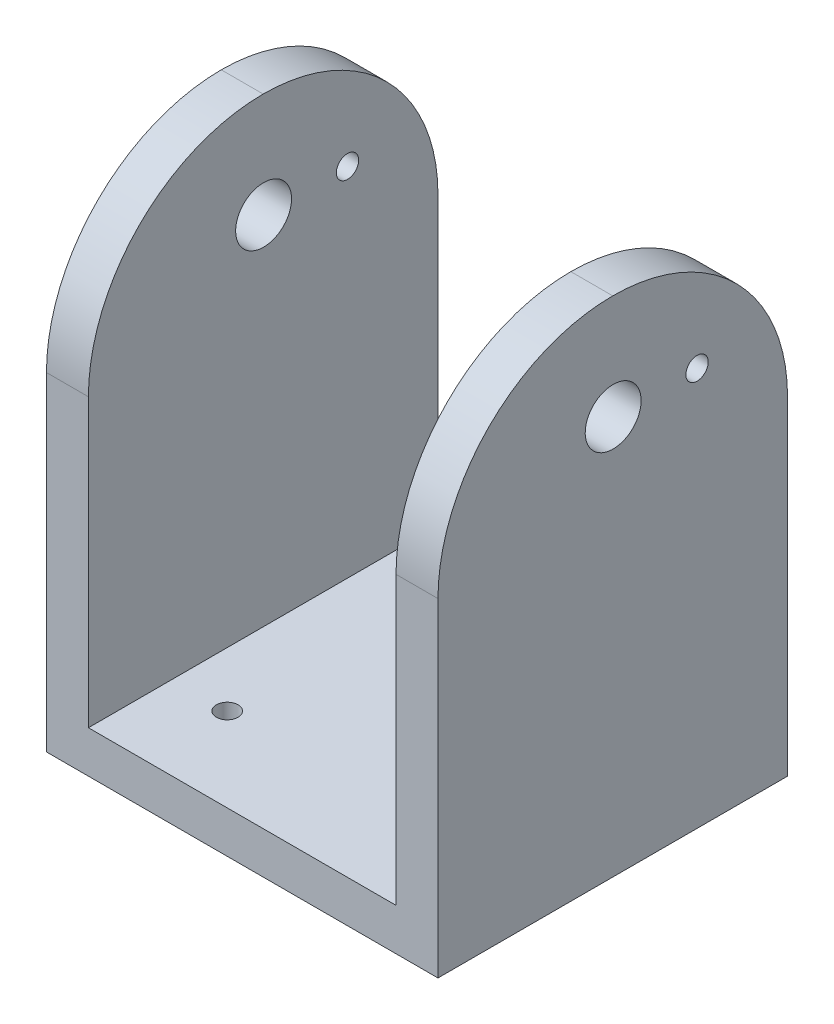
ISO-10303-21;
HEADER;
FILE_DESCRIPTION(('STEP AP214'),'2;1');
FILE_NAME('part.step','',(''),(''),'','','');
FILE_SCHEMA(('AUTOMOTIVE_DESIGN { 1 0 10303 214 1 1 1 1 }'));
ENDSEC;
DATA;
#1=APPLICATION_CONTEXT('core data for automotive mechanical design processes');
#2=APPLICATION_PROTOCOL_DEFINITION('international standard','automotive_design',2000,#1);
#3=PRODUCT_CONTEXT('',#1,'mechanical');
#4=PRODUCT('Part','Part','',(#3));
#5=PRODUCT_RELATED_PRODUCT_CATEGORY('part','',(#4));
#6=PRODUCT_DEFINITION_FORMATION('','',#4);
#7=PRODUCT_DEFINITION_CONTEXT('part definition',#1,'design');
#8=PRODUCT_DEFINITION('design','',#6,#7);
#9=PRODUCT_DEFINITION_SHAPE('','',#8);
#10=(LENGTH_UNIT() NAMED_UNIT(*) SI_UNIT(.MILLI.,.METRE.));
#11=(NAMED_UNIT(*) PLANE_ANGLE_UNIT() SI_UNIT($,.RADIAN.));
#12=(NAMED_UNIT(*) SI_UNIT($,.STERADIAN.) SOLID_ANGLE_UNIT());
#13=UNCERTAINTY_MEASURE_WITH_UNIT(LENGTH_MEASURE(1.E-05),#10,'distance_accuracy_value','');
#14=(GEOMETRIC_REPRESENTATION_CONTEXT(3) GLOBAL_UNCERTAINTY_ASSIGNED_CONTEXT((#13)) GLOBAL_UNIT_ASSIGNED_CONTEXT((#10,
#11,#12)) REPRESENTATION_CONTEXT('',''));
#15=CARTESIAN_POINT('',(0.,0.,0.));
#16=DIRECTION('',(0.,0.,1.));
#17=DIRECTION('',(1.,0.,0.));
#18=AXIS2_PLACEMENT_3D('',#15,#16,#17);
#19=CARTESIAN_POINT('',(-28.,0.,50.));
#20=DIRECTION('',(-1.,0.,0.));
#21=DIRECTION('',(0.,0.,1.));
#22=AXIS2_PLACEMENT_3D('',#19,#20,#21);
#23=PLANE('',#22);
#24=CARTESIAN_POINT('',(-28.,30.,12.9412459016393));
#25=DIRECTION('',(1.,0.,0.));
#26=DIRECTION('',(0.,1.,0.));
#27=AXIS2_PLACEMENT_3D('',#24,#25,#26);
#28=CIRCLE('',#27,1.6);
#29=CARTESIAN_POINT('',(-28.,31.6,12.9412459016393));
#30=VERTEX_POINT('',#29);
#31=EDGE_CURVE('E196',#30,#30,#28,.T.);
#32=ORIENTED_EDGE('',*,*,#31,.T.);
#33=EDGE_LOOP('',(#32));
#34=FACE_BOUND('',#33,.T.);
#35=CARTESIAN_POINT('',(-28.,30.,24.9412459016393));
#36=DIRECTION('',(1.,0.,0.));
#37=DIRECTION('',(0.,1.,0.));
#38=AXIS2_PLACEMENT_3D('',#35,#36,#37);
#39=CIRCLE('',#38,4.);
#40=CARTESIAN_POINT('',(-28.,34.,24.9412459016393));
#41=VERTEX_POINT('',#40);
#42=EDGE_CURVE('E214',#41,#41,#39,.T.);
#43=ORIENTED_EDGE('',*,*,#42,.T.);
#44=EDGE_LOOP('',(#43));
#45=FACE_BOUND('',#44,.T.);
#46=DIRECTION('',(0.,1.,0.));
#47=VECTOR('',#46,1.);
#48=CARTESIAN_POINT('',(-28.,0.,50.));
#49=LINE('',#48,#47);
#50=CARTESIAN_POINT('',(-28.,-27.,50.));
#51=VERTEX_POINT('',#50);
#52=CARTESIAN_POINT('',(-28.,20.,50.));
#53=VERTEX_POINT('',#52);
#54=EDGE_CURVE('E115',#51,#53,#49,.T.);
#55=ORIENTED_EDGE('',*,*,#54,.T.);
#56=CARTESIAN_POINT('',(-28.,20.,25.));
#57=DIRECTION('',(-1.,0.,0.));
#58=DIRECTION('',(0.,0.,1.));
#59=AXIS2_PLACEMENT_3D('',#56,#57,#58);
#60=CIRCLE('',#59,25.);
#61=CARTESIAN_POINT('',(-28.,45.,25.));
#62=VERTEX_POINT('',#61);
#63=EDGE_CURVE('E178',#53,#62,#60,.T.);
#64=ORIENTED_EDGE('',*,*,#63,.T.);
#65=CARTESIAN_POINT('',(-28.,20.,25.));
#66=DIRECTION('',(-1.,0.,0.));
#67=DIRECTION('',(0.,0.,1.));
#68=AXIS2_PLACEMENT_3D('',#65,#66,#67);
#69=CIRCLE('',#68,25.);
#70=CARTESIAN_POINT('',(-28.,20.,0.));
#71=VERTEX_POINT('',#70);
#72=EDGE_CURVE('E176',#62,#71,#69,.T.);
#73=ORIENTED_EDGE('',*,*,#72,.T.);
#74=DIRECTION('',(0.,1.,0.));
#75=VECTOR('',#74,1.);
#76=CARTESIAN_POINT('',(-28.,0.,0.));
#77=LINE('',#76,#75);
#78=CARTESIAN_POINT('',(-28.,-27.,0.));
#79=VERTEX_POINT('',#78);
#80=EDGE_CURVE('E117',#79,#71,#77,.T.);
#81=ORIENTED_EDGE('',*,*,#80,.F.);
#82=DIRECTION('',(0.,0.,-1.));
#83=VECTOR('',#82,1.);
#84=CARTESIAN_POINT('',(-28.,-27.,50.));
#85=LINE('',#84,#83);
#86=EDGE_CURVE('E112',#51,#79,#85,.T.);
#87=ORIENTED_EDGE('',*,*,#86,.F.);
#88=EDGE_LOOP('',(#55,#64,#73,#81,#87));
#89=FACE_BOUND('',#88,.T.);
#90=ADVANCED_FACE('F34',(#34,#45,#89),#23,.T.);
#91=CARTESIAN_POINT('',(0.,-27.,50.));
#92=DIRECTION('',(0.,1.,0.));
#93=DIRECTION('',(-1.,0.,0.));
#94=AXIS2_PLACEMENT_3D('',#91,#92,#93);
#95=PLANE('',#94);
#96=CARTESIAN_POINT('',(14.1421356237309,-27.,37.9999999999999));
#97=DIRECTION('',(0.,1.,0.));
#98=DIRECTION('',(0.,0.,1.));
#99=AXIS2_PLACEMENT_3D('',#96,#97,#98);
#100=CIRCLE('',#99,1.55);
#101=CARTESIAN_POINT('',(14.1421356237309,-27.,39.5499999999999));
#102=VERTEX_POINT('',#101);
#103=EDGE_CURVE('E216',#102,#102,#100,.T.);
#104=ORIENTED_EDGE('',*,*,#103,.T.);
#105=EDGE_LOOP('',(#104));
#106=FACE_BOUND('',#105,.T.);
#107=CARTESIAN_POINT('',(-14.142135623731,-27.,38.));
#108=DIRECTION('',(0.,1.,0.));
#109=DIRECTION('',(0.,0.,1.));
#110=AXIS2_PLACEMENT_3D('',#107,#108,#109);
#111=CIRCLE('',#110,1.55);
#112=CARTESIAN_POINT('',(-14.142135623731,-27.,39.55));
#113=VERTEX_POINT('',#112);
#114=EDGE_CURVE('E225',#113,#113,#111,.T.);
#115=ORIENTED_EDGE('',*,*,#114,.T.);
#116=EDGE_LOOP('',(#115));
#117=FACE_BOUND('',#116,.T.);
#118=CARTESIAN_POINT('',(0.,-27.,13.));
#119=DIRECTION('',(0.,1.,0.));
#120=DIRECTION('',(0.,0.,1.));
#121=AXIS2_PLACEMENT_3D('',#118,#119,#120);
#122=CIRCLE('',#121,1.55);
#123=CARTESIAN_POINT('',(0.,-27.,14.55));
#124=VERTEX_POINT('',#123);
#125=EDGE_CURVE('E232',#124,#124,#122,.T.);
#126=ORIENTED_EDGE('',*,*,#125,.T.);
#127=EDGE_LOOP('',(#126));
#128=FACE_BOUND('',#127,.T.);
#129=DIRECTION('',(1.,0.,0.));
#130=VECTOR('',#129,1.);
#131=CARTESIAN_POINT('',(0.,-27.,0.));
#132=LINE('',#131,#130);
#133=CARTESIAN_POINT('',(28.,-27.,0.));
#134=VERTEX_POINT('',#133);
#135=EDGE_CURVE('E156',#79,#134,#132,.T.);
#136=ORIENTED_EDGE('',*,*,#135,.T.);
#137=DIRECTION('',(0.,0.,-1.));
#138=VECTOR('',#137,1.);
#139=CARTESIAN_POINT('',(28.,-27.,50.));
#140=LINE('',#139,#138);
#141=CARTESIAN_POINT('',(28.,-27.,50.));
#142=VERTEX_POINT('',#141);
#143=EDGE_CURVE('E121',#142,#134,#140,.T.);
#144=ORIENTED_EDGE('',*,*,#143,.F.);
#145=DIRECTION('',(1.,0.,0.));
#146=VECTOR('',#145,1.);
#147=CARTESIAN_POINT('',(0.,-27.,50.));
#148=LINE('',#147,#146);
#149=EDGE_CURVE('E124',#51,#142,#148,.T.);
#150=ORIENTED_EDGE('',*,*,#149,.F.);
#151=ORIENTED_EDGE('',*,*,#86,.T.);
#152=EDGE_LOOP('',(#136,#144,#150,#151));
#153=FACE_BOUND('',#152,.T.);
#154=ADVANCED_FACE('F125',(#106,#117,#128,#153),#95,.F.);
#155=CARTESIAN_POINT('',(28.,0.,50.));
#156=DIRECTION('',(-1.,0.,0.));
#157=DIRECTION('',(0.,-1.,0.));
#158=AXIS2_PLACEMENT_3D('',#155,#156,#157);
#159=PLANE('',#158);
#160=CARTESIAN_POINT('',(28.,30.,12.9412459016393));
#161=DIRECTION('',(1.,0.,0.));
#162=DIRECTION('',(0.,1.,0.));
#163=AXIS2_PLACEMENT_3D('',#160,#161,#162);
#164=CIRCLE('',#163,1.6);
#165=CARTESIAN_POINT('',(28.,31.6,12.9412459016393));
#166=VERTEX_POINT('',#165);
#167=EDGE_CURVE('E201',#166,#166,#164,.T.);
#168=ORIENTED_EDGE('',*,*,#167,.F.);
#169=EDGE_LOOP('',(#168));
#170=FACE_BOUND('',#169,.T.);
#171=CARTESIAN_POINT('',(28.,30.,24.9412459016393));
#172=DIRECTION('',(1.,0.,0.));
#173=DIRECTION('',(0.,1.,0.));
#174=AXIS2_PLACEMENT_3D('',#171,#172,#173);
#175=CIRCLE('',#174,4.);
#176=CARTESIAN_POINT('',(28.,34.,24.9412459016393));
#177=VERTEX_POINT('',#176);
#178=EDGE_CURVE('E206',#177,#177,#175,.T.);
#179=ORIENTED_EDGE('',*,*,#178,.F.);
#180=EDGE_LOOP('',(#179));
#181=FACE_BOUND('',#180,.T.);
#182=DIRECTION('',(0.,1.,0.));
#183=VECTOR('',#182,1.);
#184=CARTESIAN_POINT('',(28.,0.,0.));
#185=LINE('',#184,#183);
#186=CARTESIAN_POINT('',(28.,20.,0.));
#187=VERTEX_POINT('',#186);
#188=EDGE_CURVE('E159',#134,#187,#185,.T.);
#189=ORIENTED_EDGE('',*,*,#188,.T.);
#190=CARTESIAN_POINT('',(28.,20.,25.));
#191=DIRECTION('',(-1.,0.,0.));
#192=DIRECTION('',(0.,-1.,0.));
#193=AXIS2_PLACEMENT_3D('',#190,#191,#192);
#194=CIRCLE('',#193,25.);
#195=CARTESIAN_POINT('',(28.,45.,25.));
#196=VERTEX_POINT('',#195);
#197=EDGE_CURVE('E57',#187,#196,#194,.F.);
#198=ORIENTED_EDGE('',*,*,#197,.T.);
#199=CARTESIAN_POINT('',(28.,20.,25.));
#200=DIRECTION('',(-1.,0.,0.));
#201=DIRECTION('',(0.,-1.,0.));
#202=AXIS2_PLACEMENT_3D('',#199,#200,#201);
#203=CIRCLE('',#202,25.);
#204=CARTESIAN_POINT('',(28.,20.,50.));
#205=VERTEX_POINT('',#204);
#206=EDGE_CURVE('E185',#196,#205,#203,.F.);
#207=ORIENTED_EDGE('',*,*,#206,.T.);
#208=DIRECTION('',(0.,1.,0.));
#209=VECTOR('',#208,1.);
#210=CARTESIAN_POINT('',(28.,0.,50.));
#211=LINE('',#210,#209);
#212=EDGE_CURVE('E130',#142,#205,#211,.T.);
#213=ORIENTED_EDGE('',*,*,#212,.F.);
#214=ORIENTED_EDGE('',*,*,#143,.T.);
#215=EDGE_LOOP('',(#189,#198,#207,#213,#214));
#216=FACE_BOUND('',#215,.T.);
#217=ADVANCED_FACE('F273',(#170,#181,#216),#159,.F.);
#218=CARTESIAN_POINT('',(22.,0.,50.));
#219=DIRECTION('',(-1.,0.,0.));
#220=DIRECTION('',(0.,0.,1.));
#221=AXIS2_PLACEMENT_3D('',#218,#219,#220);
#222=PLANE('',#221);
#223=CARTESIAN_POINT('',(22.,30.,12.9412459016393));
#224=DIRECTION('',(-1.,0.,0.));
#225=DIRECTION('',(0.,0.,1.));
#226=AXIS2_PLACEMENT_3D('',#223,#224,#225);
#227=CIRCLE('',#226,1.6);
#228=CARTESIAN_POINT('',(22.,31.6,12.9412459016393));
#229=VERTEX_POINT('',#228);
#230=EDGE_CURVE('E143',#229,#229,#227,.T.);
#231=ORIENTED_EDGE('',*,*,#230,.F.);
#232=EDGE_LOOP('',(#231));
#233=FACE_BOUND('',#232,.T.);
#234=CARTESIAN_POINT('',(22.,30.,24.9412459016393));
#235=DIRECTION('',(-1.,0.,0.));
#236=DIRECTION('',(0.,0.,1.));
#237=AXIS2_PLACEMENT_3D('',#234,#235,#236);
#238=CIRCLE('',#237,4.);
#239=CARTESIAN_POINT('',(22.,34.,24.9412459016393));
#240=VERTEX_POINT('',#239);
#241=EDGE_CURVE('E195',#240,#240,#238,.T.);
#242=ORIENTED_EDGE('',*,*,#241,.F.);
#243=EDGE_LOOP('',(#242));
#244=FACE_BOUND('',#243,.T.);
#245=CARTESIAN_POINT('',(22.,20.,25.));
#246=DIRECTION('',(-1.,0.,0.));
#247=DIRECTION('',(0.,0.,1.));
#248=AXIS2_PLACEMENT_3D('',#245,#246,#247);
#249=CIRCLE('',#248,25.);
#250=CARTESIAN_POINT('',(22.,20.,50.));
#251=VERTEX_POINT('',#250);
#252=CARTESIAN_POINT('',(22.,45.,25.));
#253=VERTEX_POINT('',#252);
#254=EDGE_CURVE('E43',#251,#253,#249,.T.);
#255=ORIENTED_EDGE('',*,*,#254,.T.);
#256=CARTESIAN_POINT('',(22.,20.,25.));
#257=DIRECTION('',(-1.,0.,0.));
#258=DIRECTION('',(0.,0.,1.));
#259=AXIS2_PLACEMENT_3D('',#256,#257,#258);
#260=CIRCLE('',#259,25.);
#261=CARTESIAN_POINT('',(22.,20.,0.));
#262=VERTEX_POINT('',#261);
#263=EDGE_CURVE('E11',#253,#262,#260,.T.);
#264=ORIENTED_EDGE('',*,*,#263,.T.);
#265=DIRECTION('',(0.,1.,0.));
#266=VECTOR('',#265,1.);
#267=CARTESIAN_POINT('',(22.,0.,0.));
#268=LINE('',#267,#266);
#269=CARTESIAN_POINT('',(22.,-21.,0.));
#270=VERTEX_POINT('',#269);
#271=EDGE_CURVE('E161',#270,#262,#268,.T.);
#272=ORIENTED_EDGE('',*,*,#271,.F.);
#273=DIRECTION('',(0.,0.,-1.));
#274=VECTOR('',#273,1.);
#275=CARTESIAN_POINT('',(22.,-21.,50.));
#276=LINE('',#275,#274);
#277=CARTESIAN_POINT('',(22.,-21.,50.));
#278=VERTEX_POINT('',#277);
#279=EDGE_CURVE('E167',#278,#270,#276,.T.);
#280=ORIENTED_EDGE('',*,*,#279,.F.);
#281=DIRECTION('',(0.,1.,0.));
#282=VECTOR('',#281,1.);
#283=CARTESIAN_POINT('',(22.,0.,50.));
#284=LINE('',#283,#282);
#285=EDGE_CURVE('E147',#278,#251,#284,.T.);
#286=ORIENTED_EDGE('',*,*,#285,.T.);
#287=EDGE_LOOP('',(#255,#264,#272,#280,#286));
#288=FACE_BOUND('',#287,.T.);
#289=ADVANCED_FACE('F245',(#233,#244,#288),#222,.T.);
#290=CARTESIAN_POINT('',(0.,-21.,50.));
#291=DIRECTION('',(0.,1.,0.));
#292=DIRECTION('',(0.,0.,1.));
#293=AXIS2_PLACEMENT_3D('',#290,#291,#292);
#294=PLANE('',#293);
#295=CARTESIAN_POINT('',(14.1421356237309,-21.,37.9999999999999));
#296=DIRECTION('',(0.,1.,0.));
#297=DIRECTION('',(0.,0.,1.));
#298=AXIS2_PLACEMENT_3D('',#295,#296,#297);
#299=CIRCLE('',#298,1.55);
#300=CARTESIAN_POINT('',(14.1421356237309,-21.,39.5499999999999));
#301=VERTEX_POINT('',#300);
#302=EDGE_CURVE('E220',#301,#301,#299,.T.);
#303=ORIENTED_EDGE('',*,*,#302,.F.);
#304=EDGE_LOOP('',(#303));
#305=FACE_BOUND('',#304,.T.);
#306=CARTESIAN_POINT('',(-14.142135623731,-21.,38.));
#307=DIRECTION('',(0.,1.,0.));
#308=DIRECTION('',(0.,0.,1.));
#309=AXIS2_PLACEMENT_3D('',#306,#307,#308);
#310=CIRCLE('',#309,1.55);
#311=CARTESIAN_POINT('',(-14.142135623731,-21.,39.55));
#312=VERTEX_POINT('',#311);
#313=EDGE_CURVE('E230',#312,#312,#310,.T.);
#314=ORIENTED_EDGE('',*,*,#313,.F.);
#315=EDGE_LOOP('',(#314));
#316=FACE_BOUND('',#315,.T.);
#317=CARTESIAN_POINT('',(0.,-21.,13.));
#318=DIRECTION('',(0.,1.,0.));
#319=DIRECTION('',(0.,0.,1.));
#320=AXIS2_PLACEMENT_3D('',#317,#318,#319);
#321=CIRCLE('',#320,1.55);
#322=CARTESIAN_POINT('',(0.,-21.,14.55));
#323=VERTEX_POINT('',#322);
#324=EDGE_CURVE('E209',#323,#323,#321,.T.);
#325=ORIENTED_EDGE('',*,*,#324,.F.);
#326=EDGE_LOOP('',(#325));
#327=FACE_BOUND('',#326,.T.);
#328=DIRECTION('',(1.,0.,0.));
#329=VECTOR('',#328,1.);
#330=CARTESIAN_POINT('',(0.,-21.,0.));
#331=LINE('',#330,#329);
#332=CARTESIAN_POINT('',(-22.,-21.,0.));
#333=VERTEX_POINT('',#332);
#334=EDGE_CURVE('E140',#333,#270,#331,.T.);
#335=ORIENTED_EDGE('',*,*,#334,.F.);
#336=DIRECTION('',(0.,0.,-1.));
#337=VECTOR('',#336,1.);
#338=CARTESIAN_POINT('',(-22.,-21.,50.));
#339=LINE('',#338,#337);
#340=CARTESIAN_POINT('',(-22.,-21.,50.));
#341=VERTEX_POINT('',#340);
#342=EDGE_CURVE('E154',#341,#333,#339,.T.);
#343=ORIENTED_EDGE('',*,*,#342,.F.);
#344=DIRECTION('',(1.,0.,0.));
#345=VECTOR('',#344,1.);
#346=CARTESIAN_POINT('',(0.,-21.,50.));
#347=LINE('',#346,#345);
#348=EDGE_CURVE('E149',#341,#278,#347,.T.);
#349=ORIENTED_EDGE('',*,*,#348,.T.);
#350=ORIENTED_EDGE('',*,*,#279,.T.);
#351=EDGE_LOOP('',(#335,#343,#349,#350));
#352=FACE_BOUND('',#351,.T.);
#353=ADVANCED_FACE('F241',(#305,#316,#327,#352),#294,.T.);
#354=CARTESIAN_POINT('',(-22.,0.,50.));
#355=DIRECTION('',(-1.,0.,0.));
#356=DIRECTION('',(0.,0.,1.));
#357=AXIS2_PLACEMENT_3D('',#354,#355,#356);
#358=PLANE('',#357);
#359=CARTESIAN_POINT('',(-22.,30.,12.9412459016393));
#360=DIRECTION('',(-1.,0.,0.));
#361=DIRECTION('',(0.,0.,1.));
#362=AXIS2_PLACEMENT_3D('',#359,#360,#361);
#363=CIRCLE('',#362,1.6);
#364=CARTESIAN_POINT('',(-22.,31.6,12.9412459016393));
#365=VERTEX_POINT('',#364);
#366=EDGE_CURVE('E38',#365,#365,#363,.T.);
#367=ORIENTED_EDGE('',*,*,#366,.T.);
#368=EDGE_LOOP('',(#367));
#369=FACE_BOUND('',#368,.T.);
#370=CARTESIAN_POINT('',(-22.,30.,24.9412459016393));
#371=DIRECTION('',(-1.,0.,0.));
#372=DIRECTION('',(0.,0.,1.));
#373=AXIS2_PLACEMENT_3D('',#370,#371,#372);
#374=CIRCLE('',#373,4.);
#375=CARTESIAN_POINT('',(-22.,34.,24.9412459016393));
#376=VERTEX_POINT('',#375);
#377=EDGE_CURVE('E193',#376,#376,#374,.T.);
#378=ORIENTED_EDGE('',*,*,#377,.T.);
#379=EDGE_LOOP('',(#378));
#380=FACE_BOUND('',#379,.T.);
#381=CARTESIAN_POINT('',(-22.,20.,25.));
#382=DIRECTION('',(-1.,0.,0.));
#383=DIRECTION('',(0.,0.,1.));
#384=AXIS2_PLACEMENT_3D('',#381,#382,#383);
#385=CIRCLE('',#384,25.);
#386=CARTESIAN_POINT('',(-22.,20.,0.));
#387=VERTEX_POINT('',#386);
#388=CARTESIAN_POINT('',(-22.,45.,25.));
#389=VERTEX_POINT('',#388);
#390=EDGE_CURVE('E120',#387,#389,#385,.F.);
#391=ORIENTED_EDGE('',*,*,#390,.T.);
#392=CARTESIAN_POINT('',(-22.,20.,25.));
#393=DIRECTION('',(-1.,0.,0.));
#394=DIRECTION('',(0.,0.,1.));
#395=AXIS2_PLACEMENT_3D('',#392,#393,#394);
#396=CIRCLE('',#395,25.);
#397=CARTESIAN_POINT('',(-22.,20.,50.));
#398=VERTEX_POINT('',#397);
#399=EDGE_CURVE('E171',#389,#398,#396,.F.);
#400=ORIENTED_EDGE('',*,*,#399,.T.);
#401=DIRECTION('',(0.,1.,0.));
#402=VECTOR('',#401,1.);
#403=CARTESIAN_POINT('',(-22.,0.,50.));
#404=LINE('',#403,#402);
#405=EDGE_CURVE('E152',#341,#398,#404,.T.);
#406=ORIENTED_EDGE('',*,*,#405,.F.);
#407=ORIENTED_EDGE('',*,*,#342,.T.);
#408=DIRECTION('',(0.,1.,0.));
#409=VECTOR('',#408,1.);
#410=CARTESIAN_POINT('',(-22.,0.,0.));
#411=LINE('',#410,#409);
#412=EDGE_CURVE('E137',#333,#387,#411,.T.);
#413=ORIENTED_EDGE('',*,*,#412,.T.);
#414=EDGE_LOOP('',(#391,#400,#406,#407,#413));
#415=FACE_BOUND('',#414,.T.);
#416=ADVANCED_FACE('F244',(#369,#380,#415),#358,.F.);
#417=CARTESIAN_POINT('',(0.,0.,50.));
#418=DIRECTION('',(0.,0.,1.));
#419=DIRECTION('',(1.,0.,0.));
#420=AXIS2_PLACEMENT_3D('',#417,#418,#419);
#421=PLANE('',#420);
#422=ORIENTED_EDGE('',*,*,#405,.T.);
#423=DIRECTION('',(1.,0.,0.));
#424=VECTOR('',#423,1.);
#425=CARTESIAN_POINT('',(0.,20.,50.));
#426=LINE('',#425,#424);
#427=EDGE_CURVE('E136',#398,#53,#426,.F.);
#428=ORIENTED_EDGE('',*,*,#427,.T.);
#429=ORIENTED_EDGE('',*,*,#54,.F.);
#430=ORIENTED_EDGE('',*,*,#149,.T.);
#431=ORIENTED_EDGE('',*,*,#212,.T.);
#432=DIRECTION('',(1.,0.,0.));
#433=VECTOR('',#432,1.);
#434=CARTESIAN_POINT('',(0.,20.,50.));
#435=LINE('',#434,#433);
#436=EDGE_CURVE('E173',#205,#251,#435,.F.);
#437=ORIENTED_EDGE('',*,*,#436,.T.);
#438=ORIENTED_EDGE('',*,*,#285,.F.);
#439=ORIENTED_EDGE('',*,*,#348,.F.);
#440=EDGE_LOOP('',(#422,#428,#429,#430,#431,#437,#438,#439));
#441=FACE_BOUND('',#440,.T.);
#442=ADVANCED_FACE('F134',(#441),#421,.T.);
#443=CARTESIAN_POINT('',(0.,0.,0.));
#444=DIRECTION('',(0.,0.,1.));
#445=DIRECTION('',(1.,0.,0.));
#446=AXIS2_PLACEMENT_3D('',#443,#444,#445);
#447=PLANE('',#446);
#448=ORIENTED_EDGE('',*,*,#80,.T.);
#449=DIRECTION('',(1.,0.,0.));
#450=VECTOR('',#449,1.);
#451=CARTESIAN_POINT('',(-22.,20.,0.));
#452=LINE('',#451,#450);
#453=EDGE_CURVE('E183',#71,#387,#452,.T.);
#454=ORIENTED_EDGE('',*,*,#453,.T.);
#455=ORIENTED_EDGE('',*,*,#412,.F.);
#456=ORIENTED_EDGE('',*,*,#334,.T.);
#457=ORIENTED_EDGE('',*,*,#271,.T.);
#458=DIRECTION('',(1.,0.,0.));
#459=VECTOR('',#458,1.);
#460=CARTESIAN_POINT('',(28.,20.,0.));
#461=LINE('',#460,#459);
#462=EDGE_CURVE('E180',#262,#187,#461,.T.);
#463=ORIENTED_EDGE('',*,*,#462,.T.);
#464=ORIENTED_EDGE('',*,*,#188,.F.);
#465=ORIENTED_EDGE('',*,*,#135,.F.);
#466=EDGE_LOOP('',(#448,#454,#455,#456,#457,#463,#464,#465));
#467=FACE_BOUND('',#466,.T.);
#468=ADVANCED_FACE('F253',(#467),#447,.F.);
#469=CARTESIAN_POINT('',(0.,20.,25.));
#470=DIRECTION('',(-1.,0.,0.));
#471=DIRECTION('',(0.,0.,1.));
#472=AXIS2_PLACEMENT_3D('',#469,#470,#471);
#473=CYLINDRICAL_SURFACE('',#472,25.);
#474=ORIENTED_EDGE('',*,*,#453,.F.);
#475=ORIENTED_EDGE('',*,*,#72,.F.);
#476=DIRECTION('',(1.,0.,0.));
#477=VECTOR('',#476,1.);
#478=CARTESIAN_POINT('',(-28.,45.,25.));
#479=LINE('',#478,#477);
#480=EDGE_CURVE('E157',#389,#62,#479,.F.);
#481=ORIENTED_EDGE('',*,*,#480,.F.);
#482=ORIENTED_EDGE('',*,*,#390,.F.);
#483=EDGE_LOOP('',(#474,#475,#481,#482));
#484=FACE_BOUND('',#483,.T.);
#485=ADVANCED_FACE('F260',(#484),#473,.T.);
#486=CARTESIAN_POINT('',(0.,20.,25.));
#487=DIRECTION('',(1.,0.,0.));
#488=DIRECTION('',(0.,0.,-1.));
#489=AXIS2_PLACEMENT_3D('',#486,#487,#488);
#490=CYLINDRICAL_SURFACE('',#489,25.);
#491=ORIENTED_EDGE('',*,*,#63,.F.);
#492=ORIENTED_EDGE('',*,*,#427,.F.);
#493=ORIENTED_EDGE('',*,*,#399,.F.);
#494=ORIENTED_EDGE('',*,*,#480,.T.);
#495=EDGE_LOOP('',(#491,#492,#493,#494));
#496=FACE_BOUND('',#495,.T.);
#497=ADVANCED_FACE('F264',(#496),#490,.T.);
#498=CARTESIAN_POINT('',(0.,20.,25.));
#499=DIRECTION('',(1.,0.,0.));
#500=DIRECTION('',(0.,0.,-1.));
#501=AXIS2_PLACEMENT_3D('',#498,#499,#500);
#502=CYLINDRICAL_SURFACE('',#501,25.);
#503=DIRECTION('',(1.,0.,0.));
#504=VECTOR('',#503,1.);
#505=CARTESIAN_POINT('',(0.,45.,25.));
#506=LINE('',#505,#504);
#507=EDGE_CURVE('E191',#253,#196,#506,.T.);
#508=ORIENTED_EDGE('',*,*,#507,.F.);
#509=ORIENTED_EDGE('',*,*,#254,.F.);
#510=ORIENTED_EDGE('',*,*,#436,.F.);
#511=ORIENTED_EDGE('',*,*,#206,.F.);
#512=EDGE_LOOP('',(#508,#509,#510,#511));
#513=FACE_BOUND('',#512,.T.);
#514=ADVANCED_FACE('F36',(#513),#502,.T.);
#515=CARTESIAN_POINT('',(0.,20.,25.));
#516=DIRECTION('',(-1.,0.,0.));
#517=DIRECTION('',(0.,0.,1.));
#518=AXIS2_PLACEMENT_3D('',#515,#516,#517);
#519=CYLINDRICAL_SURFACE('',#518,25.);
#520=ORIENTED_EDGE('',*,*,#263,.F.);
#521=ORIENTED_EDGE('',*,*,#507,.T.);
#522=ORIENTED_EDGE('',*,*,#197,.F.);
#523=ORIENTED_EDGE('',*,*,#462,.F.);
#524=EDGE_LOOP('',(#520,#521,#522,#523));
#525=FACE_BOUND('',#524,.T.);
#526=ADVANCED_FACE('F271',(#525),#519,.T.);
#527=CARTESIAN_POINT('',(-28.,30.,24.9412459016393));
#528=DIRECTION('',(1.,0.,0.));
#529=DIRECTION('',(0.,1.,0.));
#530=AXIS2_PLACEMENT_3D('',#527,#528,#529);
#531=CYLINDRICAL_SURFACE('',#530,4.);
#532=CARTESIAN_POINT('',(-28.,34.,24.9412459016393));
#533=CARTESIAN_POINT('',(-27.9375,34.,24.9412459016393));
#534=CARTESIAN_POINT('',(-27.875,34.,24.9412459016393));
#535=CARTESIAN_POINT('',(-27.75,34.,24.9412459016393));
#536=CARTESIAN_POINT('',(-27.6875,34.,24.9412459016393));
#537=CARTESIAN_POINT('',(-27.5625,34.,24.9412459016393));
#538=CARTESIAN_POINT('',(-27.5,34.,24.9412459016393));
#539=CARTESIAN_POINT('',(-27.375,34.,24.9412459016393));
#540=CARTESIAN_POINT('',(-27.3125,34.,24.9412459016393));
#541=CARTESIAN_POINT('',(-27.1875,34.,24.9412459016393));
#542=CARTESIAN_POINT('',(-27.125,34.,24.9412459016393));
#543=CARTESIAN_POINT('',(-27.,34.,24.9412459016393));
#544=CARTESIAN_POINT('',(-26.9375,34.,24.9412459016393));
#545=CARTESIAN_POINT('',(-26.8125,34.,24.9412459016393));
#546=CARTESIAN_POINT('',(-26.75,34.,24.9412459016393));
#547=CARTESIAN_POINT('',(-26.625,34.,24.9412459016393));
#548=CARTESIAN_POINT('',(-26.5625,34.,24.9412459016393));
#549=CARTESIAN_POINT('',(-26.4375,34.,24.9412459016393));
#550=CARTESIAN_POINT('',(-26.375,34.,24.9412459016393));
#551=CARTESIAN_POINT('',(-26.25,34.,24.9412459016393));
#552=CARTESIAN_POINT('',(-26.1875,34.,24.9412459016393));
#553=CARTESIAN_POINT('',(-26.0625,34.,24.9412459016393));
#554=CARTESIAN_POINT('',(-26.,34.,24.9412459016393));
#555=CARTESIAN_POINT('',(-25.875,34.,24.9412459016393));
#556=CARTESIAN_POINT('',(-25.8125,34.,24.9412459016393));
#557=CARTESIAN_POINT('',(-25.6875,34.,24.9412459016393));
#558=CARTESIAN_POINT('',(-25.625,34.,24.9412459016393));
#559=CARTESIAN_POINT('',(-25.5,34.,24.9412459016393));
#560=CARTESIAN_POINT('',(-25.4375,34.,24.9412459016393));
#561=CARTESIAN_POINT('',(-25.3125,34.,24.9412459016393));
#562=CARTESIAN_POINT('',(-25.25,34.,24.9412459016393));
#563=CARTESIAN_POINT('',(-25.125,34.,24.9412459016393));
#564=CARTESIAN_POINT('',(-25.0625,34.,24.9412459016393));
#565=CARTESIAN_POINT('',(-24.9375,34.,24.9412459016393));
#566=CARTESIAN_POINT('',(-24.875,34.,24.9412459016393));
#567=CARTESIAN_POINT('',(-24.75,34.,24.9412459016393));
#568=CARTESIAN_POINT('',(-24.6875,34.,24.9412459016393));
#569=CARTESIAN_POINT('',(-24.5625,34.,24.9412459016393));
#570=CARTESIAN_POINT('',(-24.5,34.,24.9412459016393));
#571=CARTESIAN_POINT('',(-24.375,34.,24.9412459016393));
#572=CARTESIAN_POINT('',(-24.3125,34.,24.9412459016393));
#573=CARTESIAN_POINT('',(-24.1875,34.,24.9412459016393));
#574=CARTESIAN_POINT('',(-24.125,34.,24.9412459016393));
#575=CARTESIAN_POINT('',(-24.,34.,24.9412459016393));
#576=CARTESIAN_POINT('',(-23.9375,34.,24.9412459016393));
#577=CARTESIAN_POINT('',(-23.8125,34.,24.9412459016393));
#578=CARTESIAN_POINT('',(-23.75,34.,24.9412459016393));
#579=CARTESIAN_POINT('',(-23.625,34.,24.9412459016393));
#580=CARTESIAN_POINT('',(-23.5625,34.,24.9412459016393));
#581=CARTESIAN_POINT('',(-23.4375,34.,24.9412459016393));
#582=CARTESIAN_POINT('',(-23.375,34.,24.9412459016393));
#583=CARTESIAN_POINT('',(-23.25,34.,24.9412459016393));
#584=CARTESIAN_POINT('',(-23.1875,34.,24.9412459016393));
#585=CARTESIAN_POINT('',(-23.0625,34.,24.9412459016393));
#586=CARTESIAN_POINT('',(-23.,34.,24.9412459016393));
#587=CARTESIAN_POINT('',(-22.875,34.,24.9412459016393));
#588=CARTESIAN_POINT('',(-22.8125,34.,24.9412459016393));
#589=CARTESIAN_POINT('',(-22.6875,34.,24.9412459016393));
#590=CARTESIAN_POINT('',(-22.625,34.,24.9412459016393));
#591=CARTESIAN_POINT('',(-22.5,34.,24.9412459016393));
#592=CARTESIAN_POINT('',(-22.4375,34.,24.9412459016393));
#593=CARTESIAN_POINT('',(-22.3125,34.,24.9412459016393));
#594=CARTESIAN_POINT('',(-22.25,34.,24.9412459016393));
#595=CARTESIAN_POINT('',(-22.125,34.,24.9412459016393));
#596=CARTESIAN_POINT('',(-22.0625,34.,24.9412459016393));
#597=CARTESIAN_POINT('',(-22.,34.,24.9412459016393));
#598=B_SPLINE_CURVE_WITH_KNOTS('',3,(#532,#533,#534,#535,#536,#537,#538,#539,#540,#541,#542,
#543,#544,#545,#546,#547,#548,#549,#550,#551,#552,#553,#554,#555,#556,#557,#558,#559,#560,#561,
#562,#563,#564,#565,#566,#567,#568,#569,#570,#571,#572,#573,#574,#575,#576,#577,#578,#579,#580,
#581,#582,#583,#584,#585,#586,#587,#588,#589,#590,#591,#592,#593,#594,#595,#596,#597),
.UNSPECIFIED.,.F.,.F.,(4,2,2,2,2,2,2,2,2,2,2,2,2,2,2,2,2,2,2,2,2,2,2,2,2,2,2,2,2,2,2,2,4),(0.,
0.1875,0.375,0.5625,0.750000000000001,0.937500000000001,1.125,1.3125,1.5,1.6875,1.875,2.0625,
2.25,2.4375,2.625,2.8125,3.,3.1875,3.375,3.5625,3.75,3.9375,4.125,4.3125,4.5,4.6875,4.875,
5.0625,5.25,5.4375,5.625,5.8125,6.),.UNSPECIFIED.);
#599=EDGE_CURVE('BSEAM295',#41,#376,#598,.T.);
#600=ORIENTED_EDGE('',*,*,#42,.F.);
#601=ORIENTED_EDGE('',*,*,#377,.F.);
#602=ORIENTED_EDGE('',*,*,#599,.T.);
#603=ORIENTED_EDGE('',*,*,#599,.F.);
#604=EDGE_LOOP('',(#600,#602,#601,#603));
#605=FACE_BOUND('',#604,.T.);
#606=ADVANCED_FACE('F295',(#605),#531,.F.);
#607=CARTESIAN_POINT('',(-28.,30.,12.9412459016393));
#608=DIRECTION('',(1.,0.,0.));
#609=DIRECTION('',(0.,1.,0.));
#610=AXIS2_PLACEMENT_3D('',#607,#608,#609);
#611=CYLINDRICAL_SURFACE('',#610,1.6);
#612=CARTESIAN_POINT('',(-28.,31.6,12.9412459016393));
#613=CARTESIAN_POINT('',(-27.9375,31.6,12.9412459016393));
#614=CARTESIAN_POINT('',(-27.875,31.6,12.9412459016393));
#615=CARTESIAN_POINT('',(-27.75,31.6,12.9412459016393));
#616=CARTESIAN_POINT('',(-27.6875,31.6,12.9412459016393));
#617=CARTESIAN_POINT('',(-27.5625,31.6,12.9412459016393));
#618=CARTESIAN_POINT('',(-27.5,31.6,12.9412459016393));
#619=CARTESIAN_POINT('',(-27.375,31.6,12.9412459016393));
#620=CARTESIAN_POINT('',(-27.3125,31.6,12.9412459016393));
#621=CARTESIAN_POINT('',(-27.1875,31.6,12.9412459016393));
#622=CARTESIAN_POINT('',(-27.125,31.6,12.9412459016393));
#623=CARTESIAN_POINT('',(-27.,31.6,12.9412459016393));
#624=CARTESIAN_POINT('',(-26.9375,31.6,12.9412459016393));
#625=CARTESIAN_POINT('',(-26.8125,31.6,12.9412459016393));
#626=CARTESIAN_POINT('',(-26.75,31.6,12.9412459016393));
#627=CARTESIAN_POINT('',(-26.625,31.6,12.9412459016393));
#628=CARTESIAN_POINT('',(-26.5625,31.6,12.9412459016393));
#629=CARTESIAN_POINT('',(-26.4375,31.6,12.9412459016393));
#630=CARTESIAN_POINT('',(-26.375,31.6,12.9412459016393));
#631=CARTESIAN_POINT('',(-26.25,31.6,12.9412459016393));
#632=CARTESIAN_POINT('',(-26.1875,31.6,12.9412459016393));
#633=CARTESIAN_POINT('',(-26.0625,31.6,12.9412459016393));
#634=CARTESIAN_POINT('',(-26.,31.6,12.9412459016393));
#635=CARTESIAN_POINT('',(-25.875,31.6,12.9412459016393));
#636=CARTESIAN_POINT('',(-25.8125,31.6,12.9412459016393));
#637=CARTESIAN_POINT('',(-25.6875,31.6,12.9412459016393));
#638=CARTESIAN_POINT('',(-25.625,31.6,12.9412459016393));
#639=CARTESIAN_POINT('',(-25.5,31.6,12.9412459016393));
#640=CARTESIAN_POINT('',(-25.4375,31.6,12.9412459016393));
#641=CARTESIAN_POINT('',(-25.3125,31.6,12.9412459016393));
#642=CARTESIAN_POINT('',(-25.25,31.6,12.9412459016393));
#643=CARTESIAN_POINT('',(-25.125,31.6,12.9412459016393));
#644=CARTESIAN_POINT('',(-25.0625,31.6,12.9412459016393));
#645=CARTESIAN_POINT('',(-24.9375,31.6,12.9412459016393));
#646=CARTESIAN_POINT('',(-24.875,31.6,12.9412459016393));
#647=CARTESIAN_POINT('',(-24.75,31.6,12.9412459016393));
#648=CARTESIAN_POINT('',(-24.6875,31.6,12.9412459016393));
#649=CARTESIAN_POINT('',(-24.5625,31.6,12.9412459016393));
#650=CARTESIAN_POINT('',(-24.5,31.6,12.9412459016393));
#651=CARTESIAN_POINT('',(-24.375,31.6,12.9412459016393));
#652=CARTESIAN_POINT('',(-24.3125,31.6,12.9412459016393));
#653=CARTESIAN_POINT('',(-24.1875,31.6,12.9412459016393));
#654=CARTESIAN_POINT('',(-24.125,31.6,12.9412459016393));
#655=CARTESIAN_POINT('',(-24.,31.6,12.9412459016393));
#656=CARTESIAN_POINT('',(-23.9375,31.6,12.9412459016393));
#657=CARTESIAN_POINT('',(-23.8125,31.6,12.9412459016393));
#658=CARTESIAN_POINT('',(-23.75,31.6,12.9412459016393));
#659=CARTESIAN_POINT('',(-23.625,31.6,12.9412459016393));
#660=CARTESIAN_POINT('',(-23.5625,31.6,12.9412459016393));
#661=CARTESIAN_POINT('',(-23.4375,31.6,12.9412459016393));
#662=CARTESIAN_POINT('',(-23.375,31.6,12.9412459016393));
#663=CARTESIAN_POINT('',(-23.25,31.6,12.9412459016393));
#664=CARTESIAN_POINT('',(-23.1875,31.6,12.9412459016393));
#665=CARTESIAN_POINT('',(-23.0625,31.6,12.9412459016393));
#666=CARTESIAN_POINT('',(-23.,31.6,12.9412459016393));
#667=CARTESIAN_POINT('',(-22.875,31.6,12.9412459016393));
#668=CARTESIAN_POINT('',(-22.8125,31.6,12.9412459016393));
#669=CARTESIAN_POINT('',(-22.6875,31.6,12.9412459016393));
#670=CARTESIAN_POINT('',(-22.625,31.6,12.9412459016393));
#671=CARTESIAN_POINT('',(-22.5,31.6,12.9412459016393));
#672=CARTESIAN_POINT('',(-22.4375,31.6,12.9412459016393));
#673=CARTESIAN_POINT('',(-22.3125,31.6,12.9412459016393));
#674=CARTESIAN_POINT('',(-22.25,31.6,12.9412459016393));
#675=CARTESIAN_POINT('',(-22.125,31.6,12.9412459016393));
#676=CARTESIAN_POINT('',(-22.0625,31.6,12.9412459016393));
#677=CARTESIAN_POINT('',(-22.,31.6,12.9412459016393));
#678=B_SPLINE_CURVE_WITH_KNOTS('',3,(#612,#613,#614,#615,#616,#617,#618,#619,#620,#621,#622,
#623,#624,#625,#626,#627,#628,#629,#630,#631,#632,#633,#634,#635,#636,#637,#638,#639,#640,#641,
#642,#643,#644,#645,#646,#647,#648,#649,#650,#651,#652,#653,#654,#655,#656,#657,#658,#659,#660,
#661,#662,#663,#664,#665,#666,#667,#668,#669,#670,#671,#672,#673,#674,#675,#676,#677),
.UNSPECIFIED.,.F.,.F.,(4,2,2,2,2,2,2,2,2,2,2,2,2,2,2,2,2,2,2,2,2,2,2,2,2,2,2,2,2,2,2,2,4),(0.,
0.1875,0.375,0.5625,0.750000000000001,0.937500000000001,1.125,1.3125,1.5,1.6875,1.875,2.0625,
2.25,2.4375,2.625,2.8125,3.,3.1875,3.375,3.5625,3.75,3.9375,4.125,4.3125,4.5,4.6875,4.875,
5.0625,5.25,5.4375,5.625,5.8125,6.),.UNSPECIFIED.);
#679=EDGE_CURVE('BSEAM300',#30,#365,#678,.T.);
#680=ORIENTED_EDGE('',*,*,#31,.F.);
#681=ORIENTED_EDGE('',*,*,#366,.F.);
#682=ORIENTED_EDGE('',*,*,#679,.T.);
#683=ORIENTED_EDGE('',*,*,#679,.F.);
#684=EDGE_LOOP('',(#680,#682,#681,#683));
#685=FACE_BOUND('',#684,.T.);
#686=ADVANCED_FACE('F300',(#685),#611,.F.);
#687=CARTESIAN_POINT('',(22.,34.,24.9412459016393));
#688=CARTESIAN_POINT('',(22.0625,34.,24.9412459016393));
#689=CARTESIAN_POINT('',(22.125,34.,24.9412459016393));
#690=CARTESIAN_POINT('',(22.25,34.,24.9412459016393));
#691=CARTESIAN_POINT('',(22.3125,34.,24.9412459016393));
#692=CARTESIAN_POINT('',(22.4375,34.,24.9412459016393));
#693=CARTESIAN_POINT('',(22.5,34.,24.9412459016393));
#694=CARTESIAN_POINT('',(22.625,34.,24.9412459016393));
#695=CARTESIAN_POINT('',(22.6875,34.,24.9412459016393));
#696=CARTESIAN_POINT('',(22.8125,34.,24.9412459016393));
#697=CARTESIAN_POINT('',(22.875,34.,24.9412459016393));
#698=CARTESIAN_POINT('',(23.,34.,24.9412459016393));
#699=CARTESIAN_POINT('',(23.0625,34.,24.9412459016393));
#700=CARTESIAN_POINT('',(23.1875,34.,24.9412459016393));
#701=CARTESIAN_POINT('',(23.25,34.,24.9412459016393));
#702=CARTESIAN_POINT('',(23.375,34.,24.9412459016393));
#703=CARTESIAN_POINT('',(23.4375,34.,24.9412459016393));
#704=CARTESIAN_POINT('',(23.5625,34.,24.9412459016393));
#705=CARTESIAN_POINT('',(23.625,34.,24.9412459016393));
#706=CARTESIAN_POINT('',(23.75,34.,24.9412459016393));
#707=CARTESIAN_POINT('',(23.8125,34.,24.9412459016393));
#708=CARTESIAN_POINT('',(23.9375,34.,24.9412459016393));
#709=CARTESIAN_POINT('',(24.,34.,24.9412459016393));
#710=CARTESIAN_POINT('',(24.125,34.,24.9412459016393));
#711=CARTESIAN_POINT('',(24.1875,34.,24.9412459016393));
#712=CARTESIAN_POINT('',(24.3125,34.,24.9412459016393));
#713=CARTESIAN_POINT('',(24.375,34.,24.9412459016393));
#714=CARTESIAN_POINT('',(24.5,34.,24.9412459016393));
#715=CARTESIAN_POINT('',(24.5625,34.,24.9412459016393));
#716=CARTESIAN_POINT('',(24.6875,34.,24.9412459016393));
#717=CARTESIAN_POINT('',(24.75,34.,24.9412459016393));
#718=CARTESIAN_POINT('',(24.875,34.,24.9412459016393));
#719=CARTESIAN_POINT('',(24.9375,34.,24.9412459016393));
#720=CARTESIAN_POINT('',(25.0625,34.,24.9412459016393));
#721=CARTESIAN_POINT('',(25.125,34.,24.9412459016393));
#722=CARTESIAN_POINT('',(25.25,34.,24.9412459016393));
#723=CARTESIAN_POINT('',(25.3125,34.,24.9412459016393));
#724=CARTESIAN_POINT('',(25.4375,34.,24.9412459016393));
#725=CARTESIAN_POINT('',(25.5,34.,24.9412459016393));
#726=CARTESIAN_POINT('',(25.625,34.,24.9412459016393));
#727=CARTESIAN_POINT('',(25.6875,34.,24.9412459016393));
#728=CARTESIAN_POINT('',(25.8125,34.,24.9412459016393));
#729=CARTESIAN_POINT('',(25.875,34.,24.9412459016393));
#730=CARTESIAN_POINT('',(26.,34.,24.9412459016393));
#731=CARTESIAN_POINT('',(26.0625,34.,24.9412459016393));
#732=CARTESIAN_POINT('',(26.1875,34.,24.9412459016393));
#733=CARTESIAN_POINT('',(26.25,34.,24.9412459016393));
#734=CARTESIAN_POINT('',(26.375,34.,24.9412459016393));
#735=CARTESIAN_POINT('',(26.4375,34.,24.9412459016393));
#736=CARTESIAN_POINT('',(26.5625,34.,24.9412459016393));
#737=CARTESIAN_POINT('',(26.625,34.,24.9412459016393));
#738=CARTESIAN_POINT('',(26.75,34.,24.9412459016393));
#739=CARTESIAN_POINT('',(26.8125,34.,24.9412459016393));
#740=CARTESIAN_POINT('',(26.9375,34.,24.9412459016393));
#741=CARTESIAN_POINT('',(27.,34.,24.9412459016393));
#742=CARTESIAN_POINT('',(27.125,34.,24.9412459016393));
#743=CARTESIAN_POINT('',(27.1875,34.,24.9412459016393));
#744=CARTESIAN_POINT('',(27.3125,34.,24.9412459016393));
#745=CARTESIAN_POINT('',(27.375,34.,24.9412459016393));
#746=CARTESIAN_POINT('',(27.5,34.,24.9412459016393));
#747=CARTESIAN_POINT('',(27.5625,34.,24.9412459016393));
#748=CARTESIAN_POINT('',(27.6875,34.,24.9412459016393));
#749=CARTESIAN_POINT('',(27.75,34.,24.9412459016393));
#750=CARTESIAN_POINT('',(27.875,34.,24.9412459016393));
#751=CARTESIAN_POINT('',(27.9375,34.,24.9412459016393));
#752=CARTESIAN_POINT('',(28.,34.,24.9412459016393));
#753=B_SPLINE_CURVE_WITH_KNOTS('',3,(#687,#688,#689,#690,#691,#692,#693,#694,#695,#696,#697,
#698,#699,#700,#701,#702,#703,#704,#705,#706,#707,#708,#709,#710,#711,#712,#713,#714,#715,#716,
#717,#718,#719,#720,#721,#722,#723,#724,#725,#726,#727,#728,#729,#730,#731,#732,#733,#734,#735,
#736,#737,#738,#739,#740,#741,#742,#743,#744,#745,#746,#747,#748,#749,#750,#751,#752),
.UNSPECIFIED.,.F.,.F.,(4,2,2,2,2,2,2,2,2,2,2,2,2,2,2,2,2,2,2,2,2,2,2,2,2,2,2,2,2,2,2,2,4),(0.,
0.1875,0.375,0.5625,0.750000000000001,0.937500000000001,1.125,1.3125,1.5,1.68749999999999,
1.87499999999999,2.06249999999999,2.25,2.4375,2.625,2.8125,3.,3.1875,3.375,3.5625,3.75,3.9375,
4.125,4.3125,4.49999999999999,4.6875,4.87499999999999,5.06249999999999,5.24999999999999,
5.43749999999999,5.62499999999999,5.81249999999999,5.99999999999999),.UNSPECIFIED.);
#754=EDGE_CURVE('BSEAM303',#240,#177,#753,.T.);
#755=ORIENTED_EDGE('',*,*,#241,.T.);
#756=ORIENTED_EDGE('',*,*,#178,.T.);
#757=ORIENTED_EDGE('',*,*,#754,.T.);
#758=ORIENTED_EDGE('',*,*,#754,.F.);
#759=EDGE_LOOP('',(#755,#757,#756,#758));
#760=FACE_BOUND('',#759,.T.);
#761=ADVANCED_FACE('F303',(#760),#531,.F.);
#762=CARTESIAN_POINT('',(22.,31.6,12.9412459016393));
#763=CARTESIAN_POINT('',(22.0625,31.6,12.9412459016393));
#764=CARTESIAN_POINT('',(22.125,31.6,12.9412459016393));
#765=CARTESIAN_POINT('',(22.25,31.6,12.9412459016393));
#766=CARTESIAN_POINT('',(22.3125,31.6,12.9412459016393));
#767=CARTESIAN_POINT('',(22.4375,31.6,12.9412459016393));
#768=CARTESIAN_POINT('',(22.5,31.6,12.9412459016393));
#769=CARTESIAN_POINT('',(22.625,31.6,12.9412459016393));
#770=CARTESIAN_POINT('',(22.6875,31.6,12.9412459016393));
#771=CARTESIAN_POINT('',(22.8125,31.6,12.9412459016393));
#772=CARTESIAN_POINT('',(22.875,31.6,12.9412459016393));
#773=CARTESIAN_POINT('',(23.,31.6,12.9412459016393));
#774=CARTESIAN_POINT('',(23.0625,31.6,12.9412459016393));
#775=CARTESIAN_POINT('',(23.1875,31.6,12.9412459016393));
#776=CARTESIAN_POINT('',(23.25,31.6,12.9412459016393));
#777=CARTESIAN_POINT('',(23.375,31.6,12.9412459016393));
#778=CARTESIAN_POINT('',(23.4375,31.6,12.9412459016393));
#779=CARTESIAN_POINT('',(23.5625,31.6,12.9412459016393));
#780=CARTESIAN_POINT('',(23.625,31.6,12.9412459016393));
#781=CARTESIAN_POINT('',(23.75,31.6,12.9412459016393));
#782=CARTESIAN_POINT('',(23.8125,31.6,12.9412459016393));
#783=CARTESIAN_POINT('',(23.9375,31.6,12.9412459016393));
#784=CARTESIAN_POINT('',(24.,31.6,12.9412459016393));
#785=CARTESIAN_POINT('',(24.125,31.6,12.9412459016393));
#786=CARTESIAN_POINT('',(24.1875,31.6,12.9412459016393));
#787=CARTESIAN_POINT('',(24.3125,31.6,12.9412459016393));
#788=CARTESIAN_POINT('',(24.375,31.6,12.9412459016393));
#789=CARTESIAN_POINT('',(24.5,31.6,12.9412459016393));
#790=CARTESIAN_POINT('',(24.5625,31.6,12.9412459016393));
#791=CARTESIAN_POINT('',(24.6875,31.6,12.9412459016393));
#792=CARTESIAN_POINT('',(24.75,31.6,12.9412459016393));
#793=CARTESIAN_POINT('',(24.875,31.6,12.9412459016393));
#794=CARTESIAN_POINT('',(24.9375,31.6,12.9412459016393));
#795=CARTESIAN_POINT('',(25.0625,31.6,12.9412459016393));
#796=CARTESIAN_POINT('',(25.125,31.6,12.9412459016393));
#797=CARTESIAN_POINT('',(25.25,31.6,12.9412459016393));
#798=CARTESIAN_POINT('',(25.3125,31.6,12.9412459016393));
#799=CARTESIAN_POINT('',(25.4375,31.6,12.9412459016393));
#800=CARTESIAN_POINT('',(25.5,31.6,12.9412459016393));
#801=CARTESIAN_POINT('',(25.625,31.6,12.9412459016393));
#802=CARTESIAN_POINT('',(25.6875,31.6,12.9412459016393));
#803=CARTESIAN_POINT('',(25.8125,31.6,12.9412459016393));
#804=CARTESIAN_POINT('',(25.875,31.6,12.9412459016393));
#805=CARTESIAN_POINT('',(26.,31.6,12.9412459016393));
#806=CARTESIAN_POINT('',(26.0625,31.6,12.9412459016393));
#807=CARTESIAN_POINT('',(26.1875,31.6,12.9412459016393));
#808=CARTESIAN_POINT('',(26.25,31.6,12.9412459016393));
#809=CARTESIAN_POINT('',(26.375,31.6,12.9412459016393));
#810=CARTESIAN_POINT('',(26.4375,31.6,12.9412459016393));
#811=CARTESIAN_POINT('',(26.5625,31.6,12.9412459016393));
#812=CARTESIAN_POINT('',(26.625,31.6,12.9412459016393));
#813=CARTESIAN_POINT('',(26.75,31.6,12.9412459016393));
#814=CARTESIAN_POINT('',(26.8125,31.6,12.9412459016393));
#815=CARTESIAN_POINT('',(26.9375,31.6,12.9412459016393));
#816=CARTESIAN_POINT('',(27.,31.6,12.9412459016393));
#817=CARTESIAN_POINT('',(27.125,31.6,12.9412459016393));
#818=CARTESIAN_POINT('',(27.1875,31.6,12.9412459016393));
#819=CARTESIAN_POINT('',(27.3125,31.6,12.9412459016393));
#820=CARTESIAN_POINT('',(27.375,31.6,12.9412459016393));
#821=CARTESIAN_POINT('',(27.5,31.6,12.9412459016393));
#822=CARTESIAN_POINT('',(27.5625,31.6,12.9412459016393));
#823=CARTESIAN_POINT('',(27.6875,31.6,12.9412459016393));
#824=CARTESIAN_POINT('',(27.75,31.6,12.9412459016393));
#825=CARTESIAN_POINT('',(27.875,31.6,12.9412459016393));
#826=CARTESIAN_POINT('',(27.9375,31.6,12.9412459016393));
#827=CARTESIAN_POINT('',(28.,31.6,12.9412459016393));
#828=B_SPLINE_CURVE_WITH_KNOTS('',3,(#762,#763,#764,#765,#766,#767,#768,#769,#770,#771,#772,
#773,#774,#775,#776,#777,#778,#779,#780,#781,#782,#783,#784,#785,#786,#787,#788,#789,#790,#791,
#792,#793,#794,#795,#796,#797,#798,#799,#800,#801,#802,#803,#804,#805,#806,#807,#808,#809,#810,
#811,#812,#813,#814,#815,#816,#817,#818,#819,#820,#821,#822,#823,#824,#825,#826,#827),
.UNSPECIFIED.,.F.,.F.,(4,2,2,2,2,2,2,2,2,2,2,2,2,2,2,2,2,2,2,2,2,2,2,2,2,2,2,2,2,2,2,2,4),(0.,
0.1875,0.375,0.5625,0.750000000000001,0.937500000000001,1.125,1.3125,1.5,1.68749999999999,
1.87499999999999,2.06249999999999,2.25,2.4375,2.625,2.8125,3.,3.1875,3.375,3.5625,3.75,3.9375,
4.125,4.3125,4.49999999999999,4.6875,4.87499999999999,5.06249999999999,5.24999999999999,
5.43749999999999,5.62499999999999,5.81249999999999,5.99999999999999),.UNSPECIFIED.);
#829=EDGE_CURVE('BSEAM377',#229,#166,#828,.T.);
#830=ORIENTED_EDGE('',*,*,#230,.T.);
#831=ORIENTED_EDGE('',*,*,#167,.T.);
#832=ORIENTED_EDGE('',*,*,#829,.T.);
#833=ORIENTED_EDGE('',*,*,#829,.F.);
#834=EDGE_LOOP('',(#830,#832,#831,#833));
#835=FACE_BOUND('',#834,.T.);
#836=ADVANCED_FACE('F377',(#835),#611,.F.);
#837=CARTESIAN_POINT('',(0.,-27.,13.));
#838=DIRECTION('',(0.,1.,0.));
#839=DIRECTION('',(0.,0.,1.));
#840=AXIS2_PLACEMENT_3D('',#837,#838,#839);
#841=CYLINDRICAL_SURFACE('',#840,1.55);
#842=ORIENTED_EDGE('',*,*,#125,.F.);
#843=EDGE_LOOP('',(#842));
#844=FACE_BOUND('',#843,.T.);
#845=ORIENTED_EDGE('',*,*,#324,.T.);
#846=EDGE_LOOP('',(#845));
#847=FACE_BOUND('',#846,.T.);
#848=ADVANCED_FACE('F239',(#844,#847),#841,.F.);
#849=CARTESIAN_POINT('',(-14.142135623731,-27.,38.));
#850=DIRECTION('',(0.,1.,0.));
#851=DIRECTION('',(0.,0.,1.));
#852=AXIS2_PLACEMENT_3D('',#849,#850,#851);
#853=CYLINDRICAL_SURFACE('',#852,1.55);
#854=ORIENTED_EDGE('',*,*,#114,.F.);
#855=EDGE_LOOP('',(#854));
#856=FACE_BOUND('',#855,.T.);
#857=ORIENTED_EDGE('',*,*,#313,.T.);
#858=EDGE_LOOP('',(#857));
#859=FACE_BOUND('',#858,.T.);
#860=ADVANCED_FACE('F397',(#856,#859),#853,.F.);
#861=CARTESIAN_POINT('',(14.1421356237309,-27.,37.9999999999999));
#862=DIRECTION('',(0.,1.,0.));
#863=DIRECTION('',(0.,0.,1.));
#864=AXIS2_PLACEMENT_3D('',#861,#862,#863);
#865=CYLINDRICAL_SURFACE('',#864,1.55);
#866=ORIENTED_EDGE('',*,*,#103,.F.);
#867=EDGE_LOOP('',(#866));
#868=FACE_BOUND('',#867,.T.);
#869=ORIENTED_EDGE('',*,*,#302,.T.);
#870=EDGE_LOOP('',(#869));
#871=FACE_BOUND('',#870,.T.);
#872=ADVANCED_FACE('F406',(#868,#871),#865,.F.);
#873=CLOSED_SHELL('',(#90,#154,#217,#289,#353,#416,#442,#468,#485,#497,#514,#526,#606,#686,#761,
#836,#848,#860,#872));
#874=MANIFOLD_SOLID_BREP('B2',#873);
#875=ADVANCED_BREP_SHAPE_REPRESENTATION('',(#18,#874),#14);
#876=SHAPE_DEFINITION_REPRESENTATION(#9,#875);
ENDSEC;
END-ISO-10303-21;
